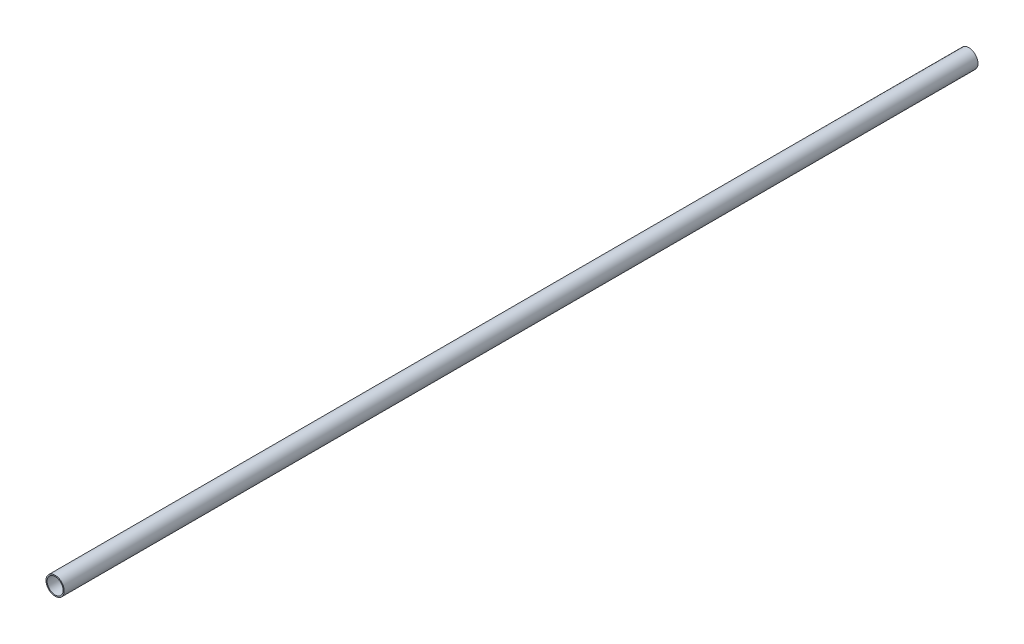
ISO-10303-21;
HEADER;
FILE_DESCRIPTION(('STEP AP214'),'2;1');
FILE_NAME('part.step','',(''),(''),'','','');
FILE_SCHEMA(('AUTOMOTIVE_DESIGN { 1 0 10303 214 1 1 1 1 }'));
ENDSEC;
DATA;
#1=APPLICATION_CONTEXT('core data for automotive mechanical design processes');
#2=APPLICATION_PROTOCOL_DEFINITION('international standard','automotive_design',2000,#1);
#3=PRODUCT_CONTEXT('',#1,'mechanical');
#4=PRODUCT('Part','Part','',(#3));
#5=PRODUCT_RELATED_PRODUCT_CATEGORY('part','',(#4));
#6=PRODUCT_DEFINITION_FORMATION('','',#4);
#7=PRODUCT_DEFINITION_CONTEXT('part definition',#1,'design');
#8=PRODUCT_DEFINITION('design','',#6,#7);
#9=PRODUCT_DEFINITION_SHAPE('','',#8);
#10=(LENGTH_UNIT() NAMED_UNIT(*) SI_UNIT(.MILLI.,.METRE.));
#11=(NAMED_UNIT(*) PLANE_ANGLE_UNIT() SI_UNIT($,.RADIAN.));
#12=(NAMED_UNIT(*) SI_UNIT($,.STERADIAN.) SOLID_ANGLE_UNIT());
#13=UNCERTAINTY_MEASURE_WITH_UNIT(LENGTH_MEASURE(1.E-05),#10,'distance_accuracy_value','');
#14=(GEOMETRIC_REPRESENTATION_CONTEXT(3) GLOBAL_UNCERTAINTY_ASSIGNED_CONTEXT((#13)) GLOBAL_UNIT_ASSIGNED_CONTEXT((#10,
#11,#12)) REPRESENTATION_CONTEXT('',''));
#15=CARTESIAN_POINT('',(0.,0.,0.));
#16=DIRECTION('',(0.,0.,1.));
#17=DIRECTION('',(1.,0.,0.));
#18=AXIS2_PLACEMENT_3D('',#15,#16,#17);
#19=CARTESIAN_POINT('',(0.,0.,400.));
#20=DIRECTION('',(0.,0.,1.));
#21=DIRECTION('',(1.,0.,0.));
#22=AXIS2_PLACEMENT_3D('',#19,#20,#21);
#23=PLANE('',#22);
#24=CARTESIAN_POINT('',(0.,0.,400.));
#25=DIRECTION('',(0.,0.,1.));
#26=DIRECTION('',(1.,0.,0.));
#27=AXIS2_PLACEMENT_3D('',#24,#25,#26);
#28=CIRCLE('',#27,4.);
#29=CARTESIAN_POINT('',(4.,0.,400.));
#30=VERTEX_POINT('',#29);
#31=EDGE_CURVE('E10',#30,#30,#28,.T.);
#32=ORIENTED_EDGE('',*,*,#31,.T.);
#33=EDGE_LOOP('',(#32));
#34=FACE_BOUND('',#33,.T.);
#35=CARTESIAN_POINT('',(0.,0.,400.));
#36=DIRECTION('',(0.,0.,1.));
#37=DIRECTION('',(1.,0.,0.));
#38=AXIS2_PLACEMENT_3D('',#35,#36,#37);
#39=CIRCLE('',#38,3.5);
#40=CARTESIAN_POINT('',(3.5,0.,400.));
#41=VERTEX_POINT('',#40);
#42=EDGE_CURVE('E48',#41,#41,#39,.T.);
#43=ORIENTED_EDGE('',*,*,#42,.F.);
#44=EDGE_LOOP('',(#43));
#45=FACE_BOUND('',#44,.T.);
#46=ADVANCED_FACE('F37',(#34,#45),#23,.T.);
#47=CARTESIAN_POINT('',(0.,0.,0.));
#48=DIRECTION('',(0.,0.,1.));
#49=DIRECTION('',(1.,0.,0.));
#50=AXIS2_PLACEMENT_3D('',#47,#48,#49);
#51=PLANE('',#50);
#52=CARTESIAN_POINT('',(0.,0.,0.));
#53=DIRECTION('',(0.,0.,1.));
#54=DIRECTION('',(1.,0.,0.));
#55=AXIS2_PLACEMENT_3D('',#52,#53,#54);
#56=CIRCLE('',#55,4.);
#57=CARTESIAN_POINT('',(4.,0.,0.));
#58=VERTEX_POINT('',#57);
#59=EDGE_CURVE('E41',#58,#58,#56,.T.);
#60=ORIENTED_EDGE('',*,*,#59,.F.);
#61=EDGE_LOOP('',(#60));
#62=FACE_BOUND('',#61,.T.);
#63=CARTESIAN_POINT('',(0.,0.,0.));
#64=DIRECTION('',(0.,0.,1.));
#65=DIRECTION('',(1.,0.,0.));
#66=AXIS2_PLACEMENT_3D('',#63,#64,#65);
#67=CIRCLE('',#66,3.5);
#68=CARTESIAN_POINT('',(3.5,0.,0.));
#69=VERTEX_POINT('',#68);
#70=EDGE_CURVE('E50',#69,#69,#67,.T.);
#71=ORIENTED_EDGE('',*,*,#70,.T.);
#72=EDGE_LOOP('',(#71));
#73=FACE_BOUND('',#72,.T.);
#74=ADVANCED_FACE('F60',(#62,#73),#51,.F.);
#75=CARTESIAN_POINT('',(0.,0.,400.));
#76=DIRECTION('',(0.,0.,-1.));
#77=DIRECTION('',(-1.,0.,0.));
#78=AXIS2_PLACEMENT_3D('',#75,#76,#77);
#79=CYLINDRICAL_SURFACE('',#78,4.);
#80=ORIENTED_EDGE('',*,*,#31,.F.);
#81=EDGE_LOOP('',(#80));
#82=FACE_BOUND('',#81,.T.);
#83=ORIENTED_EDGE('',*,*,#59,.T.);
#84=EDGE_LOOP('',(#83));
#85=FACE_BOUND('',#84,.T.);
#86=ADVANCED_FACE('F39',(#82,#85),#79,.T.);
#87=CARTESIAN_POINT('',(0.,0.,400.));
#88=DIRECTION('',(0.,0.,-1.));
#89=DIRECTION('',(-1.,0.,0.));
#90=AXIS2_PLACEMENT_3D('',#87,#88,#89);
#91=CYLINDRICAL_SURFACE('',#90,3.5);
#92=ORIENTED_EDGE('',*,*,#42,.T.);
#93=EDGE_LOOP('',(#92));
#94=FACE_BOUND('',#93,.T.);
#95=ORIENTED_EDGE('',*,*,#70,.F.);
#96=EDGE_LOOP('',(#95));
#97=FACE_BOUND('',#96,.T.);
#98=ADVANCED_FACE('F56',(#94,#97),#91,.F.);
#99=CLOSED_SHELL('',(#46,#74,#86,#98));
#100=MANIFOLD_SOLID_BREP('B2',#99);
#101=ADVANCED_BREP_SHAPE_REPRESENTATION('',(#18,#100),#14);
#102=SHAPE_DEFINITION_REPRESENTATION(#9,#101);
ENDSEC;
END-ISO-10303-21;
